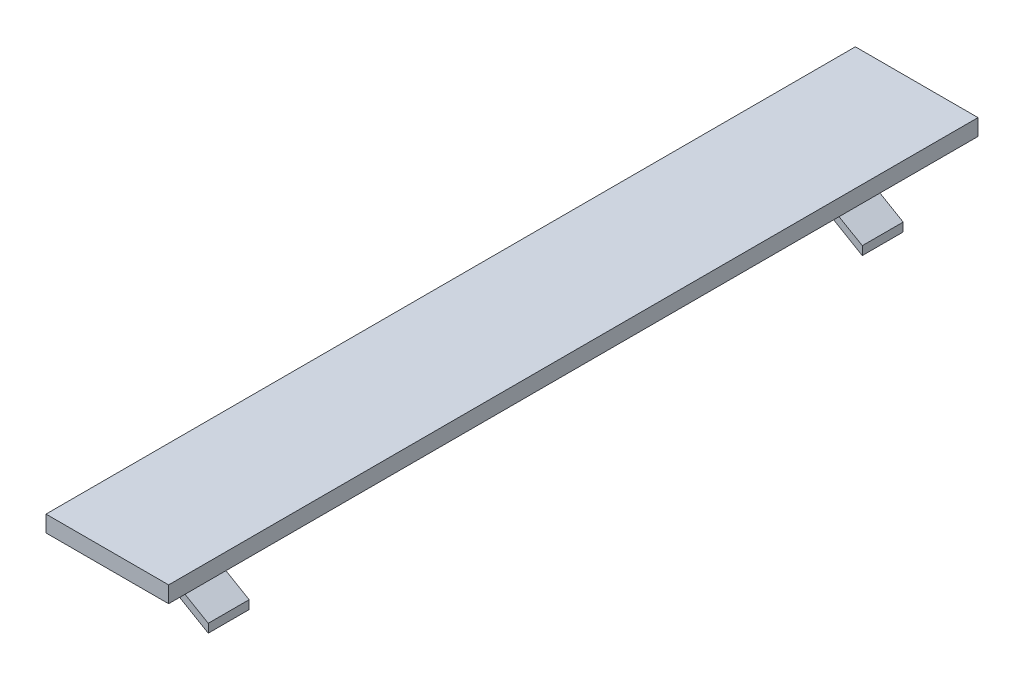
ISO-10303-21;
HEADER;
FILE_DESCRIPTION(('STEP AP214'),'2;1');
FILE_NAME('part.step','',(''),(''),'','','');
FILE_SCHEMA(('AUTOMOTIVE_DESIGN { 1 0 10303 214 1 1 1 1 }'));
ENDSEC;
DATA;
#1=APPLICATION_CONTEXT('core data for automotive mechanical design processes');
#2=APPLICATION_PROTOCOL_DEFINITION('international standard','automotive_design',2000,#1);
#3=PRODUCT_CONTEXT('',#1,'mechanical');
#4=PRODUCT('Part','Part','',(#3));
#5=PRODUCT_RELATED_PRODUCT_CATEGORY('part','',(#4));
#6=PRODUCT_DEFINITION_FORMATION('','',#4);
#7=PRODUCT_DEFINITION_CONTEXT('part definition',#1,'design');
#8=PRODUCT_DEFINITION('design','',#6,#7);
#9=PRODUCT_DEFINITION_SHAPE('','',#8);
#10=(LENGTH_UNIT() NAMED_UNIT(*) SI_UNIT(.MILLI.,.METRE.));
#11=(NAMED_UNIT(*) PLANE_ANGLE_UNIT() SI_UNIT($,.RADIAN.));
#12=(NAMED_UNIT(*) SI_UNIT($,.STERADIAN.) SOLID_ANGLE_UNIT());
#13=UNCERTAINTY_MEASURE_WITH_UNIT(LENGTH_MEASURE(1.E-05),#10,'distance_accuracy_value','');
#14=(GEOMETRIC_REPRESENTATION_CONTEXT(3) GLOBAL_UNCERTAINTY_ASSIGNED_CONTEXT((#13)) GLOBAL_UNIT_ASSIGNED_CONTEXT((#10,
#11,#12)) REPRESENTATION_CONTEXT('',''));
#15=CARTESIAN_POINT('',(0.,0.,0.));
#16=DIRECTION('',(0.,0.,1.));
#17=DIRECTION('',(1.,0.,0.));
#18=AXIS2_PLACEMENT_3D('',#15,#16,#17);
#19=CARTESIAN_POINT('',(0.,0.,0.));
#20=DIRECTION('',(0.,1.,0.));
#21=DIRECTION('',(0.,0.,1.));
#22=AXIS2_PLACEMENT_3D('',#19,#20,#21);
#23=PLANE('',#22);
#24=DIRECTION('',(0.,0.,-1.));
#25=VECTOR('',#24,1.);
#26=CARTESIAN_POINT('',(-4.8105497780339,0.,85.));
#27=LINE('',#26,#25);
#28=CARTESIAN_POINT('',(-4.8105497780339,0.,85.));
#29=VERTEX_POINT('',#28);
#30=CARTESIAN_POINT('',(-4.8105497780339,0.,80.));
#31=VERTEX_POINT('',#30);
#32=EDGE_CURVE('E60',#29,#31,#27,.T.);
#33=ORIENTED_EDGE('',*,*,#32,.F.);
#34=DIRECTION('',(-1.,0.,0.));
#35=VECTOR('',#34,1.);
#36=CARTESIAN_POINT('',(-2.99922191693628,0.,85.));
#37=LINE('',#36,#35);
#38=CARTESIAN_POINT('',(-2.99922191693628,0.,85.));
#39=VERTEX_POINT('',#38);
#40=EDGE_CURVE('E55',#39,#29,#37,.T.);
#41=ORIENTED_EDGE('',*,*,#40,.F.);
#42=DIRECTION('',(0.,0.,-1.));
#43=VECTOR('',#42,1.);
#44=CARTESIAN_POINT('',(-2.99922191693628,0.,85.));
#45=LINE('',#44,#43);
#46=CARTESIAN_POINT('',(-2.99922191693628,0.,80.));
#47=VERTEX_POINT('',#46);
#48=EDGE_CURVE('E134',#39,#47,#45,.T.);
#49=ORIENTED_EDGE('',*,*,#48,.T.);
#50=DIRECTION('',(-1.,0.,0.));
#51=VECTOR('',#50,1.);
#52=CARTESIAN_POINT('',(-2.99922191693628,0.,80.));
#53=LINE('',#52,#51);
#54=EDGE_CURVE('E401',#47,#31,#53,.T.);
#55=ORIENTED_EDGE('',*,*,#54,.T.);
#56=EDGE_LOOP('',(#33,#41,#49,#55));
#57=FACE_BOUND('',#56,.T.);
#58=DIRECTION('',(0.,0.,1.));
#59=VECTOR('',#58,1.);
#60=CARTESIAN_POINT('',(-10.2725118483412,0.,-9.15284360189572));
#61=LINE('',#60,#59);
#62=CARTESIAN_POINT('',(-10.2725118483412,0.,-9.15284360189572));
#63=VERTEX_POINT('',#62);
#64=CARTESIAN_POINT('',(-10.2725118483412,0.,89.8471563981043));
#65=VERTEX_POINT('',#64);
#66=EDGE_CURVE('E199',#63,#65,#61,.T.);
#67=ORIENTED_EDGE('',*,*,#66,.F.);
#68=DIRECTION('',(-1.,0.,0.));
#69=VECTOR('',#68,1.);
#70=CARTESIAN_POINT('',(-10.2725118483412,0.,-9.15284360189572));
#71=LINE('',#70,#69);
#72=CARTESIAN_POINT('',(4.72748815165876,0.,-9.15284360189572));
#73=VERTEX_POINT('',#72);
#74=EDGE_CURVE('E205',#73,#63,#71,.T.);
#75=ORIENTED_EDGE('',*,*,#74,.F.);
#76=DIRECTION('',(0.,0.,-1.));
#77=VECTOR('',#76,1.);
#78=CARTESIAN_POINT('',(4.72748815165876,0.,-9.15284360189572));
#79=LINE('',#78,#77);
#80=CARTESIAN_POINT('',(4.72748815165878,0.,89.8471563981043));
#81=VERTEX_POINT('',#80);
#82=EDGE_CURVE('E221',#81,#73,#79,.T.);
#83=ORIENTED_EDGE('',*,*,#82,.F.);
#84=DIRECTION('',(1.,0.,0.));
#85=VECTOR('',#84,1.);
#86=CARTESIAN_POINT('',(-10.2725118483412,0.,89.8471563981043));
#87=LINE('',#86,#85);
#88=EDGE_CURVE('E218',#65,#81,#87,.T.);
#89=ORIENTED_EDGE('',*,*,#88,.F.);
#90=EDGE_LOOP('',(#67,#75,#83,#89));
#91=FACE_BOUND('',#90,.T.);
#92=DIRECTION('',(-1.,0.,0.));
#93=VECTOR('',#92,1.);
#94=CARTESIAN_POINT('',(-2.99922191693628,0.,5.));
#95=LINE('',#94,#93);
#96=CARTESIAN_POINT('',(-2.99922191693628,0.,5.));
#97=VERTEX_POINT('',#96);
#98=CARTESIAN_POINT('',(-4.8105497780339,0.,5.));
#99=VERTEX_POINT('',#98);
#100=EDGE_CURVE('E163',#97,#99,#95,.T.);
#101=ORIENTED_EDGE('',*,*,#100,.F.);
#102=DIRECTION('',(0.,0.,-1.));
#103=VECTOR('',#102,1.);
#104=CARTESIAN_POINT('',(-2.99922191693628,0.,5.));
#105=LINE('',#104,#103);
#106=CARTESIAN_POINT('',(-2.99922191693628,0.,0.));
#107=VERTEX_POINT('',#106);
#108=EDGE_CURVE('E176',#97,#107,#105,.T.);
#109=ORIENTED_EDGE('',*,*,#108,.T.);
#110=DIRECTION('',(-1.,0.,0.));
#111=VECTOR('',#110,1.);
#112=CARTESIAN_POINT('',(-2.99922191693628,0.,0.));
#113=LINE('',#112,#111);
#114=CARTESIAN_POINT('',(-4.8105497780339,0.,0.));
#115=VERTEX_POINT('',#114);
#116=EDGE_CURVE('E153',#107,#115,#113,.T.);
#117=ORIENTED_EDGE('',*,*,#116,.T.);
#118=DIRECTION('',(0.,0.,-1.));
#119=VECTOR('',#118,1.);
#120=CARTESIAN_POINT('',(-4.8105497780339,0.,5.));
#121=LINE('',#120,#119);
#122=EDGE_CURVE('E196',#99,#115,#121,.T.);
#123=ORIENTED_EDGE('',*,*,#122,.F.);
#124=EDGE_LOOP('',(#101,#109,#117,#123));
#125=FACE_BOUND('',#124,.T.);
#126=ADVANCED_FACE('F39',(#57,#91,#125),#23,.F.);
#127=CARTESIAN_POINT('',(-10.2725118483412,2.,-9.15284360189572));
#128=DIRECTION('',(1.,0.,0.));
#129=DIRECTION('',(0.,0.,-1.));
#130=AXIS2_PLACEMENT_3D('',#127,#128,#129);
#131=PLANE('',#130);
#132=ORIENTED_EDGE('',*,*,#66,.T.);
#133=DIRECTION('',(0.,-1.,0.));
#134=VECTOR('',#133,1.);
#135=CARTESIAN_POINT('',(-10.2725118483412,2.,89.8471563981043));
#136=LINE('',#135,#134);
#137=CARTESIAN_POINT('',(-10.2725118483412,2.,89.8471563981043));
#138=VERTEX_POINT('',#137);
#139=EDGE_CURVE('E11',#138,#65,#136,.T.);
#140=ORIENTED_EDGE('',*,*,#139,.F.);
#141=DIRECTION('',(0.,0.,1.));
#142=VECTOR('',#141,1.);
#143=CARTESIAN_POINT('',(-10.2725118483412,2.,-9.15284360189572));
#144=LINE('',#143,#142);
#145=CARTESIAN_POINT('',(-10.2725118483412,2.,-9.15284360189572));
#146=VERTEX_POINT('',#145);
#147=EDGE_CURVE('E200',#146,#138,#144,.T.);
#148=ORIENTED_EDGE('',*,*,#147,.F.);
#149=DIRECTION('',(0.,-1.,0.));
#150=VECTOR('',#149,1.);
#151=CARTESIAN_POINT('',(-10.2725118483412,2.,-9.15284360189572));
#152=LINE('',#151,#150);
#153=EDGE_CURVE('E214',#146,#63,#152,.T.);
#154=ORIENTED_EDGE('',*,*,#153,.T.);
#155=EDGE_LOOP('',(#132,#140,#148,#154));
#156=FACE_BOUND('',#155,.T.);
#157=ADVANCED_FACE('F41',(#156),#131,.F.);
#158=CARTESIAN_POINT('',(-10.2725118483412,2.,89.8471563981043));
#159=DIRECTION('',(0.,0.,-1.));
#160=DIRECTION('',(-1.,0.,0.));
#161=AXIS2_PLACEMENT_3D('',#158,#159,#160);
#162=PLANE('',#161);
#163=ORIENTED_EDGE('',*,*,#88,.T.);
#164=DIRECTION('',(0.,-1.,0.));
#165=VECTOR('',#164,1.);
#166=CARTESIAN_POINT('',(4.72748815165878,2.,89.8471563981043));
#167=LINE('',#166,#165);
#168=CARTESIAN_POINT('',(4.72748815165878,2.,89.8471563981043));
#169=VERTEX_POINT('',#168);
#170=EDGE_CURVE('E48',#169,#81,#167,.T.);
#171=ORIENTED_EDGE('',*,*,#170,.F.);
#172=DIRECTION('',(1.,0.,0.));
#173=VECTOR('',#172,1.);
#174=CARTESIAN_POINT('',(-10.2725118483412,2.,89.8471563981043));
#175=LINE('',#174,#173);
#176=EDGE_CURVE('E204',#138,#169,#175,.T.);
#177=ORIENTED_EDGE('',*,*,#176,.F.);
#178=ORIENTED_EDGE('',*,*,#139,.T.);
#179=EDGE_LOOP('',(#163,#171,#177,#178));
#180=FACE_BOUND('',#179,.T.);
#181=ADVANCED_FACE('F254',(#180),#162,.F.);
#182=CARTESIAN_POINT('',(4.72748815165876,2.,-9.15284360189572));
#183=DIRECTION('',(-1.,0.,0.));
#184=DIRECTION('',(0.,0.,1.));
#185=AXIS2_PLACEMENT_3D('',#182,#183,#184);
#186=PLANE('',#185);
#187=ORIENTED_EDGE('',*,*,#82,.T.);
#188=DIRECTION('',(0.,-1.,0.));
#189=VECTOR('',#188,1.);
#190=CARTESIAN_POINT('',(4.72748815165876,2.,-9.15284360189572));
#191=LINE('',#190,#189);
#192=CARTESIAN_POINT('',(4.72748815165876,2.,-9.15284360189572));
#193=VERTEX_POINT('',#192);
#194=EDGE_CURVE('E229',#193,#73,#191,.T.);
#195=ORIENTED_EDGE('',*,*,#194,.F.);
#196=DIRECTION('',(0.,0.,-1.));
#197=VECTOR('',#196,1.);
#198=CARTESIAN_POINT('',(4.72748815165876,2.,-9.15284360189572));
#199=LINE('',#198,#197);
#200=EDGE_CURVE('E208',#169,#193,#199,.T.);
#201=ORIENTED_EDGE('',*,*,#200,.F.);
#202=ORIENTED_EDGE('',*,*,#170,.T.);
#203=EDGE_LOOP('',(#187,#195,#201,#202));
#204=FACE_BOUND('',#203,.T.);
#205=ADVANCED_FACE('F238',(#204),#186,.F.);
#206=CARTESIAN_POINT('',(-10.2725118483412,2.,-9.15284360189572));
#207=DIRECTION('',(0.,0.,1.));
#208=DIRECTION('',(1.,0.,0.));
#209=AXIS2_PLACEMENT_3D('',#206,#207,#208);
#210=PLANE('',#209);
#211=ORIENTED_EDGE('',*,*,#74,.T.);
#212=ORIENTED_EDGE('',*,*,#153,.F.);
#213=DIRECTION('',(-1.,0.,0.));
#214=VECTOR('',#213,1.);
#215=CARTESIAN_POINT('',(-10.2725118483412,2.,-9.15284360189572));
#216=LINE('',#215,#214);
#217=EDGE_CURVE('E211',#193,#146,#216,.T.);
#218=ORIENTED_EDGE('',*,*,#217,.F.);
#219=ORIENTED_EDGE('',*,*,#194,.T.);
#220=EDGE_LOOP('',(#211,#212,#218,#219));
#221=FACE_BOUND('',#220,.T.);
#222=ADVANCED_FACE('F247',(#221),#210,.F.);
#223=CARTESIAN_POINT('',(0.,2.,0.));
#224=DIRECTION('',(0.,1.,0.));
#225=DIRECTION('',(0.,0.,1.));
#226=AXIS2_PLACEMENT_3D('',#223,#224,#225);
#227=PLANE('',#226);
#228=ORIENTED_EDGE('',*,*,#147,.T.);
#229=ORIENTED_EDGE('',*,*,#176,.T.);
#230=ORIENTED_EDGE('',*,*,#200,.T.);
#231=ORIENTED_EDGE('',*,*,#217,.T.);
#232=EDGE_LOOP('',(#228,#229,#230,#231));
#233=FACE_BOUND('',#232,.T.);
#234=ADVANCED_FACE('F253',(#233),#227,.T.);
#235=CARTESIAN_POINT('',(-4.8105497780339,0.,5.));
#236=DIRECTION('',(0.502523312743845,0.864563658818107,0.));
#237=DIRECTION('',(-0.864563658818107,0.502523312743845,0.));
#238=AXIS2_PLACEMENT_3D('',#235,#236,#237);
#239=PLANE('',#238);
#240=DIRECTION('',(0.864563658818107,-0.502523312743845,0.));
#241=VECTOR('',#240,1.);
#242=CARTESIAN_POINT('',(-4.8105497780339,0.,0.));
#243=LINE('',#242,#241);
#244=CARTESIAN_POINT('',(4.72748815165878,-5.54393695434521,0.));
#245=VERTEX_POINT('',#244);
#246=EDGE_CURVE('E158',#115,#245,#243,.T.);
#247=ORIENTED_EDGE('',*,*,#246,.T.);
#248=DIRECTION('',(0.,0.,-1.));
#249=VECTOR('',#248,1.);
#250=CARTESIAN_POINT('',(4.72748815165878,-5.54393695434521,5.));
#251=LINE('',#250,#249);
#252=CARTESIAN_POINT('',(4.72748815165878,-5.54393695434521,5.));
#253=VERTEX_POINT('',#252);
#254=EDGE_CURVE('E192',#253,#245,#251,.T.);
#255=ORIENTED_EDGE('',*,*,#254,.F.);
#256=DIRECTION('',(0.864563658818107,-0.502523312743845,0.));
#257=VECTOR('',#256,1.);
#258=CARTESIAN_POINT('',(-4.8105497780339,0.,5.));
#259=LINE('',#258,#257);
#260=EDGE_CURVE('E167',#99,#253,#259,.T.);
#261=ORIENTED_EDGE('',*,*,#260,.F.);
#262=ORIENTED_EDGE('',*,*,#122,.T.);
#263=EDGE_LOOP('',(#247,#255,#261,#262));
#264=FACE_BOUND('',#263,.T.);
#265=ADVANCED_FACE('F272',(#264),#239,.F.);
#266=CARTESIAN_POINT('',(4.72748815165878,-5.54393695434521,5.));
#267=DIRECTION('',(-1.,0.,0.));
#268=DIRECTION('',(0.,0.,1.));
#269=AXIS2_PLACEMENT_3D('',#266,#267,#268);
#270=PLANE('',#269);
#271=DIRECTION('',(0.,1.,0.));
#272=VECTOR('',#271,1.);
#273=CARTESIAN_POINT('',(4.72748815165878,-5.54393695434521,0.));
#274=LINE('',#273,#272);
#275=CARTESIAN_POINT('',(4.72748815165878,-4.49111167312957,0.));
#276=VERTEX_POINT('',#275);
#277=EDGE_CURVE('E180',#245,#276,#274,.T.);
#278=ORIENTED_EDGE('',*,*,#277,.T.);
#279=DIRECTION('',(0.,0.,-1.));
#280=VECTOR('',#279,1.);
#281=CARTESIAN_POINT('',(4.72748815165878,-4.49111167312957,5.));
#282=LINE('',#281,#280);
#283=CARTESIAN_POINT('',(4.72748815165878,-4.49111167312957,5.));
#284=VERTEX_POINT('',#283);
#285=EDGE_CURVE('E188',#284,#276,#282,.T.);
#286=ORIENTED_EDGE('',*,*,#285,.F.);
#287=DIRECTION('',(0.,1.,0.));
#288=VECTOR('',#287,1.);
#289=CARTESIAN_POINT('',(4.72748815165878,-5.54393695434521,5.));
#290=LINE('',#289,#288);
#291=EDGE_CURVE('E171',#253,#284,#290,.T.);
#292=ORIENTED_EDGE('',*,*,#291,.F.);
#293=ORIENTED_EDGE('',*,*,#254,.T.);
#294=EDGE_LOOP('',(#278,#286,#292,#293));
#295=FACE_BOUND('',#294,.T.);
#296=ADVANCED_FACE('F276',(#295),#270,.F.);
#297=CARTESIAN_POINT('',(4.72748815165878,-4.49111167312957,5.));
#298=DIRECTION('',(-0.502523312743845,-0.864563658818107,0.));
#299=DIRECTION('',(0.864563658818107,-0.502523312743845,0.));
#300=AXIS2_PLACEMENT_3D('',#297,#298,#299);
#301=PLANE('',#300);
#302=DIRECTION('',(-0.864563658818107,0.502523312743845,0.));
#303=VECTOR('',#302,1.);
#304=CARTESIAN_POINT('',(4.72748815165878,-4.49111167312957,0.));
#305=LINE('',#304,#303);
#306=EDGE_CURVE('E168',#276,#107,#305,.T.);
#307=ORIENTED_EDGE('',*,*,#306,.T.);
#308=ORIENTED_EDGE('',*,*,#108,.F.);
#309=DIRECTION('',(-0.864563658818107,0.502523312743845,0.));
#310=VECTOR('',#309,1.);
#311=CARTESIAN_POINT('',(4.72748815165878,-4.49111167312957,5.));
#312=LINE('',#311,#310);
#313=EDGE_CURVE('E174',#284,#97,#312,.T.);
#314=ORIENTED_EDGE('',*,*,#313,.F.);
#315=ORIENTED_EDGE('',*,*,#285,.T.);
#316=EDGE_LOOP('',(#307,#308,#314,#315));
#317=FACE_BOUND('',#316,.T.);
#318=ADVANCED_FACE('F281',(#317),#301,.F.);
#319=CARTESIAN_POINT('',(0.,0.,5.));
#320=DIRECTION('',(0.,0.,-1.));
#321=DIRECTION('',(-1.,0.,0.));
#322=AXIS2_PLACEMENT_3D('',#319,#320,#321);
#323=PLANE('',#322);
#324=ORIENTED_EDGE('',*,*,#100,.T.);
#325=ORIENTED_EDGE('',*,*,#260,.T.);
#326=ORIENTED_EDGE('',*,*,#291,.T.);
#327=ORIENTED_EDGE('',*,*,#313,.T.);
#328=EDGE_LOOP('',(#324,#325,#326,#327));
#329=FACE_BOUND('',#328,.T.);
#330=ADVANCED_FACE('F287',(#329),#323,.F.);
#331=CARTESIAN_POINT('',(0.,0.,0.));
#332=DIRECTION('',(0.,0.,-1.));
#333=DIRECTION('',(-1.,0.,0.));
#334=AXIS2_PLACEMENT_3D('',#331,#332,#333);
#335=PLANE('',#334);
#336=ORIENTED_EDGE('',*,*,#116,.F.);
#337=ORIENTED_EDGE('',*,*,#306,.F.);
#338=ORIENTED_EDGE('',*,*,#277,.F.);
#339=ORIENTED_EDGE('',*,*,#246,.F.);
#340=EDGE_LOOP('',(#336,#337,#338,#339));
#341=FACE_BOUND('',#340,.T.);
#342=ADVANCED_FACE('F289',(#341),#335,.T.);
#343=CARTESIAN_POINT('',(4.72748815165878,-5.54393695434521,85.));
#344=DIRECTION('',(-1.,0.,0.));
#345=DIRECTION('',(0.,0.,1.));
#346=AXIS2_PLACEMENT_3D('',#343,#344,#345);
#347=PLANE('',#346);
#348=DIRECTION('',(0.,1.,0.));
#349=VECTOR('',#348,1.);
#350=CARTESIAN_POINT('',(4.72748815165878,-5.54393695434521,80.));
#351=LINE('',#350,#349);
#352=CARTESIAN_POINT('',(4.72748815165878,-5.54393695434521,80.));
#353=VERTEX_POINT('',#352);
#354=CARTESIAN_POINT('',(4.72748815165878,-4.49111167312957,80.));
#355=VERTEX_POINT('',#354);
#356=EDGE_CURVE('E151',#353,#355,#351,.T.);
#357=ORIENTED_EDGE('',*,*,#356,.T.);
#358=DIRECTION('',(0.,0.,-1.));
#359=VECTOR('',#358,1.);
#360=CARTESIAN_POINT('',(4.72748815165878,-4.49111167312957,85.));
#361=LINE('',#360,#359);
#362=CARTESIAN_POINT('',(4.72748815165878,-4.49111167312957,85.));
#363=VERTEX_POINT('',#362);
#364=EDGE_CURVE('E132',#363,#355,#361,.T.);
#365=ORIENTED_EDGE('',*,*,#364,.F.);
#366=DIRECTION('',(0.,1.,0.));
#367=VECTOR('',#366,1.);
#368=CARTESIAN_POINT('',(4.72748815165878,-5.54393695434521,85.));
#369=LINE('',#368,#367);
#370=CARTESIAN_POINT('',(4.72748815165878,-5.54393695434521,85.));
#371=VERTEX_POINT('',#370);
#372=EDGE_CURVE('E137',#371,#363,#369,.T.);
#373=ORIENTED_EDGE('',*,*,#372,.F.);
#374=DIRECTION('',(0.,0.,-1.));
#375=VECTOR('',#374,1.);
#376=CARTESIAN_POINT('',(4.72748815165878,-5.54393695434521,85.));
#377=LINE('',#376,#375);
#378=EDGE_CURVE('E410',#371,#353,#377,.T.);
#379=ORIENTED_EDGE('',*,*,#378,.T.);
#380=EDGE_LOOP('',(#357,#365,#373,#379));
#381=FACE_BOUND('',#380,.T.);
#382=ADVANCED_FACE('F149',(#381),#347,.F.);
#383=CARTESIAN_POINT('',(4.72748815165878,-4.49111167312957,85.));
#384=DIRECTION('',(-0.502523312743845,-0.864563658818107,0.));
#385=DIRECTION('',(0.864563658818107,-0.502523312743845,0.));
#386=AXIS2_PLACEMENT_3D('',#383,#384,#385);
#387=PLANE('',#386);
#388=DIRECTION('',(-0.864563658818107,0.502523312743845,0.));
#389=VECTOR('',#388,1.);
#390=CARTESIAN_POINT('',(4.72748815165878,-4.49111167312957,80.));
#391=LINE('',#390,#389);
#392=EDGE_CURVE('E397',#355,#47,#391,.T.);
#393=ORIENTED_EDGE('',*,*,#392,.T.);
#394=ORIENTED_EDGE('',*,*,#48,.F.);
#395=DIRECTION('',(-0.864563658818107,0.502523312743845,0.));
#396=VECTOR('',#395,1.);
#397=CARTESIAN_POINT('',(4.72748815165878,-4.49111167312957,85.));
#398=LINE('',#397,#396);
#399=EDGE_CURVE('E127',#363,#39,#398,.T.);
#400=ORIENTED_EDGE('',*,*,#399,.F.);
#401=ORIENTED_EDGE('',*,*,#364,.T.);
#402=EDGE_LOOP('',(#393,#394,#400,#401));
#403=FACE_BOUND('',#402,.T.);
#404=ADVANCED_FACE('F130',(#403),#387,.F.);
#405=CARTESIAN_POINT('',(-4.8105497780339,0.,85.));
#406=DIRECTION('',(0.502523312743845,0.864563658818107,0.));
#407=DIRECTION('',(-0.864563658818107,0.502523312743845,0.));
#408=AXIS2_PLACEMENT_3D('',#405,#406,#407);
#409=PLANE('',#408);
#410=DIRECTION('',(0.864563658818107,-0.502523312743845,0.));
#411=VECTOR('',#410,1.);
#412=CARTESIAN_POINT('',(-4.8105497780339,0.,80.));
#413=LINE('',#412,#411);
#414=EDGE_CURVE('E147',#31,#353,#413,.T.);
#415=ORIENTED_EDGE('',*,*,#414,.T.);
#416=ORIENTED_EDGE('',*,*,#378,.F.);
#417=DIRECTION('',(0.864563658818107,-0.502523312743845,0.));
#418=VECTOR('',#417,1.);
#419=CARTESIAN_POINT('',(-4.8105497780339,0.,85.));
#420=LINE('',#419,#418);
#421=EDGE_CURVE('E142',#29,#371,#420,.T.);
#422=ORIENTED_EDGE('',*,*,#421,.F.);
#423=ORIENTED_EDGE('',*,*,#32,.T.);
#424=EDGE_LOOP('',(#415,#416,#422,#423));
#425=FACE_BOUND('',#424,.T.);
#426=ADVANCED_FACE('F300',(#425),#409,.F.);
#427=CARTESIAN_POINT('',(0.,0.,85.));
#428=DIRECTION('',(0.,0.,1.));
#429=DIRECTION('',(1.,0.,0.));
#430=AXIS2_PLACEMENT_3D('',#427,#428,#429);
#431=PLANE('',#430);
#432=ORIENTED_EDGE('',*,*,#372,.T.);
#433=ORIENTED_EDGE('',*,*,#399,.T.);
#434=ORIENTED_EDGE('',*,*,#40,.T.);
#435=ORIENTED_EDGE('',*,*,#421,.T.);
#436=EDGE_LOOP('',(#432,#433,#434,#435));
#437=FACE_BOUND('',#436,.T.);
#438=ADVANCED_FACE('F140',(#437),#431,.T.);
#439=CARTESIAN_POINT('',(0.,0.,80.));
#440=DIRECTION('',(0.,0.,1.));
#441=DIRECTION('',(1.,0.,0.));
#442=AXIS2_PLACEMENT_3D('',#439,#440,#441);
#443=PLANE('',#442);
#444=ORIENTED_EDGE('',*,*,#356,.F.);
#445=ORIENTED_EDGE('',*,*,#414,.F.);
#446=ORIENTED_EDGE('',*,*,#54,.F.);
#447=ORIENTED_EDGE('',*,*,#392,.F.);
#448=EDGE_LOOP('',(#444,#445,#446,#447));
#449=FACE_BOUND('',#448,.T.);
#450=ADVANCED_FACE('F304',(#449),#443,.F.);
#451=CLOSED_SHELL('',(#126,#157,#181,#205,#222,#234,#265,#296,#318,#330,#342,#382,#404,#426,
#438,#450));
#452=MANIFOLD_SOLID_BREP('B2',#451);
#453=ADVANCED_BREP_SHAPE_REPRESENTATION('',(#18,#452),#14);
#454=SHAPE_DEFINITION_REPRESENTATION(#9,#453);
ENDSEC;
END-ISO-10303-21;
